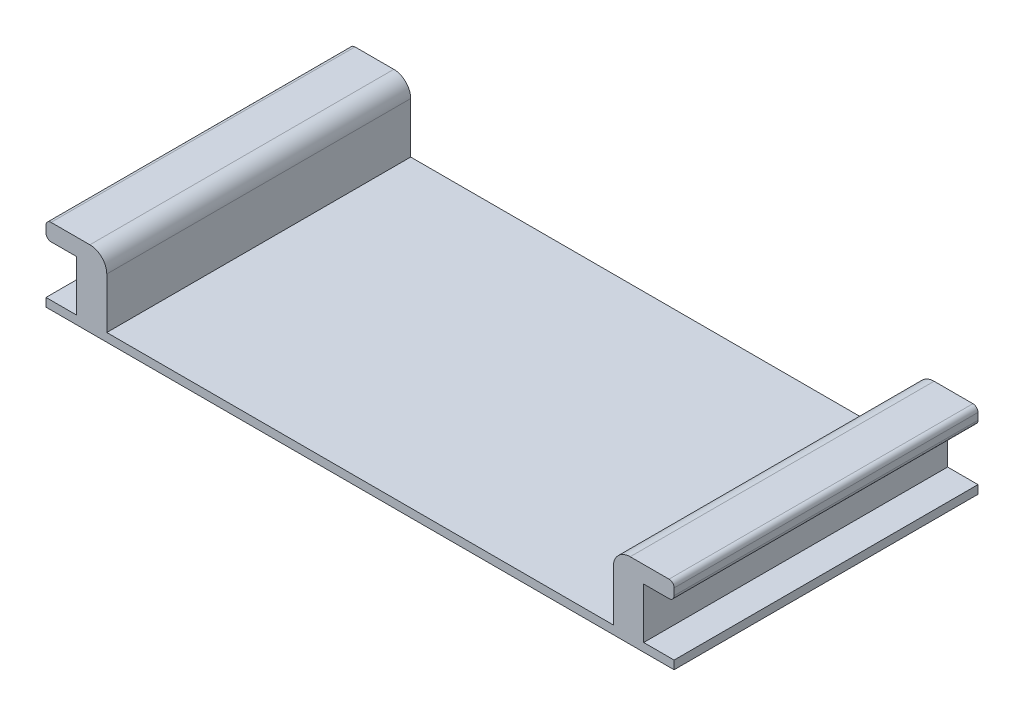
ISO-10303-21;
HEADER;
FILE_DESCRIPTION(('STEP AP214'),'2;1');
FILE_NAME('part.step','',(''),(''),'','','');
FILE_SCHEMA(('AUTOMOTIVE_DESIGN { 1 0 10303 214 1 1 1 1 }'));
ENDSEC;
DATA;
#1=APPLICATION_CONTEXT('core data for automotive mechanical design processes');
#2=APPLICATION_PROTOCOL_DEFINITION('international standard','automotive_design',2000,#1);
#3=PRODUCT_CONTEXT('',#1,'mechanical');
#4=PRODUCT('Part','Part','',(#3));
#5=PRODUCT_RELATED_PRODUCT_CATEGORY('part','',(#4));
#6=PRODUCT_DEFINITION_FORMATION('','',#4);
#7=PRODUCT_DEFINITION_CONTEXT('part definition',#1,'design');
#8=PRODUCT_DEFINITION('design','',#6,#7);
#9=PRODUCT_DEFINITION_SHAPE('','',#8);
#10=(LENGTH_UNIT() NAMED_UNIT(*) SI_UNIT(.MILLI.,.METRE.));
#11=(NAMED_UNIT(*) PLANE_ANGLE_UNIT() SI_UNIT($,.RADIAN.));
#12=(NAMED_UNIT(*) SI_UNIT($,.STERADIAN.) SOLID_ANGLE_UNIT());
#13=UNCERTAINTY_MEASURE_WITH_UNIT(LENGTH_MEASURE(1.E-05),#10,'distance_accuracy_value','');
#14=(GEOMETRIC_REPRESENTATION_CONTEXT(3) GLOBAL_UNCERTAINTY_ASSIGNED_CONTEXT((#13)) GLOBAL_UNIT_ASSIGNED_CONTEXT((#10,
#11,#12)) REPRESENTATION_CONTEXT('',''));
#15=CARTESIAN_POINT('',(0.,0.,0.));
#16=DIRECTION('',(0.,0.,1.));
#17=DIRECTION('',(1.,0.,0.));
#18=AXIS2_PLACEMENT_3D('',#15,#16,#17);
#19=CARTESIAN_POINT('',(-18.6,-0.5,18.));
#20=DIRECTION('',(1.,0.,0.));
#21=DIRECTION('',(0.,0.,-1.));
#22=AXIS2_PLACEMENT_3D('',#19,#20,#21);
#23=PLANE('',#22);
#24=DIRECTION('',(0.,-1.,0.));
#25=VECTOR('',#24,1.);
#26=CARTESIAN_POINT('',(-18.6,-0.5,0.));
#27=LINE('',#26,#25);
#28=CARTESIAN_POINT('',(-18.6,0.,0.));
#29=VERTEX_POINT('',#28);
#30=CARTESIAN_POINT('',(-18.6,-0.5,0.));
#31=VERTEX_POINT('',#30);
#32=EDGE_CURVE('E214',#29,#31,#27,.T.);
#33=ORIENTED_EDGE('',*,*,#32,.T.);
#34=DIRECTION('',(0.,0.,-1.));
#35=VECTOR('',#34,1.);
#36=CARTESIAN_POINT('',(-18.6,-0.5,18.));
#37=LINE('',#36,#35);
#38=CARTESIAN_POINT('',(-18.6,-0.5,18.));
#39=VERTEX_POINT('',#38);
#40=EDGE_CURVE('E193',#39,#31,#37,.T.);
#41=ORIENTED_EDGE('',*,*,#40,.F.);
#42=DIRECTION('',(0.,-1.,0.));
#43=VECTOR('',#42,1.);
#44=CARTESIAN_POINT('',(-18.6,-0.5,18.));
#45=LINE('',#44,#43);
#46=CARTESIAN_POINT('',(-18.6,0.,18.));
#47=VERTEX_POINT('',#46);
#48=EDGE_CURVE('E200',#47,#39,#45,.T.);
#49=ORIENTED_EDGE('',*,*,#48,.F.);
#50=DIRECTION('',(0.,0.,-1.));
#51=VECTOR('',#50,1.);
#52=CARTESIAN_POINT('',(-18.6,0.,18.));
#53=LINE('',#52,#51);
#54=EDGE_CURVE('E324',#47,#29,#53,.T.);
#55=ORIENTED_EDGE('',*,*,#54,.T.);
#56=EDGE_LOOP('',(#33,#41,#49,#55));
#57=FACE_BOUND('',#56,.T.);
#58=ADVANCED_FACE('F39',(#57),#23,.F.);
#59=CARTESIAN_POINT('',(-18.6,-0.5,18.));
#60=DIRECTION('',(0.,1.,0.));
#61=DIRECTION('',(0.,0.,1.));
#62=AXIS2_PLACEMENT_3D('',#59,#60,#61);
#63=PLANE('',#62);
#64=DIRECTION('',(1.,0.,0.));
#65=VECTOR('',#64,1.);
#66=CARTESIAN_POINT('',(-18.6,-0.5,0.));
#67=LINE('',#66,#65);
#68=CARTESIAN_POINT('',(18.6,-0.5,0.));
#69=VERTEX_POINT('',#68);
#70=EDGE_CURVE('E372',#31,#69,#67,.T.);
#71=ORIENTED_EDGE('',*,*,#70,.T.);
#72=DIRECTION('',(0.,0.,-1.));
#73=VECTOR('',#72,1.);
#74=CARTESIAN_POINT('',(18.6,-0.5,18.));
#75=LINE('',#74,#73);
#76=CARTESIAN_POINT('',(18.6,-0.5,18.));
#77=VERTEX_POINT('',#76);
#78=EDGE_CURVE('E196',#77,#69,#75,.T.);
#79=ORIENTED_EDGE('',*,*,#78,.F.);
#80=DIRECTION('',(1.,0.,0.));
#81=VECTOR('',#80,1.);
#82=CARTESIAN_POINT('',(-18.6,-0.5,18.));
#83=LINE('',#82,#81);
#84=EDGE_CURVE('E189',#39,#77,#83,.T.);
#85=ORIENTED_EDGE('',*,*,#84,.F.);
#86=ORIENTED_EDGE('',*,*,#40,.T.);
#87=EDGE_LOOP('',(#71,#79,#85,#86));
#88=FACE_BOUND('',#87,.T.);
#89=ADVANCED_FACE('F191',(#88),#63,.F.);
#90=CARTESIAN_POINT('',(18.6,-0.5,18.));
#91=DIRECTION('',(-1.,0.,0.));
#92=DIRECTION('',(0.,0.,1.));
#93=AXIS2_PLACEMENT_3D('',#90,#91,#92);
#94=PLANE('',#93);
#95=DIRECTION('',(0.,1.,0.));
#96=VECTOR('',#95,1.);
#97=CARTESIAN_POINT('',(18.6,-0.5,0.));
#98=LINE('',#97,#96);
#99=CARTESIAN_POINT('',(18.6,0.,0.));
#100=VERTEX_POINT('',#99);
#101=EDGE_CURVE('E363',#69,#100,#98,.T.);
#102=ORIENTED_EDGE('',*,*,#101,.T.);
#103=DIRECTION('',(0.,0.,-1.));
#104=VECTOR('',#103,1.);
#105=CARTESIAN_POINT('',(18.6,0.,18.));
#106=LINE('',#105,#104);
#107=CARTESIAN_POINT('',(18.6,0.,18.));
#108=VERTEX_POINT('',#107);
#109=EDGE_CURVE('E223',#108,#100,#106,.T.);
#110=ORIENTED_EDGE('',*,*,#109,.F.);
#111=DIRECTION('',(0.,1.,0.));
#112=VECTOR('',#111,1.);
#113=CARTESIAN_POINT('',(18.6,-0.5,18.));
#114=LINE('',#113,#112);
#115=EDGE_CURVE('E199',#77,#108,#114,.T.);
#116=ORIENTED_EDGE('',*,*,#115,.F.);
#117=ORIENTED_EDGE('',*,*,#78,.T.);
#118=EDGE_LOOP('',(#102,#110,#116,#117));
#119=FACE_BOUND('',#118,.T.);
#120=ADVANCED_FACE('F431',(#119),#94,.F.);
#121=CARTESIAN_POINT('',(16.8,0.,18.));
#122=DIRECTION('',(0.,-1.,0.));
#123=DIRECTION('',(0.,0.,-1.));
#124=AXIS2_PLACEMENT_3D('',#121,#122,#123);
#125=PLANE('',#124);
#126=DIRECTION('',(-1.,0.,0.));
#127=VECTOR('',#126,1.);
#128=CARTESIAN_POINT('',(16.8,0.,0.));
#129=LINE('',#128,#127);
#130=CARTESIAN_POINT('',(16.8,0.,0.));
#131=VERTEX_POINT('',#130);
#132=EDGE_CURVE('E358',#100,#131,#129,.T.);
#133=ORIENTED_EDGE('',*,*,#132,.T.);
#134=DIRECTION('',(0.,0.,-1.));
#135=VECTOR('',#134,1.);
#136=CARTESIAN_POINT('',(16.8,0.,18.));
#137=LINE('',#136,#135);
#138=CARTESIAN_POINT('',(16.8,0.,18.));
#139=VERTEX_POINT('',#138);
#140=EDGE_CURVE('E347',#139,#131,#137,.T.);
#141=ORIENTED_EDGE('',*,*,#140,.F.);
#142=DIRECTION('',(-1.,0.,0.));
#143=VECTOR('',#142,1.);
#144=CARTESIAN_POINT('',(16.8,0.,18.));
#145=LINE('',#144,#143);
#146=EDGE_CURVE('E359',#108,#139,#145,.T.);
#147=ORIENTED_EDGE('',*,*,#146,.F.);
#148=ORIENTED_EDGE('',*,*,#109,.T.);
#149=EDGE_LOOP('',(#133,#141,#147,#148));
#150=FACE_BOUND('',#149,.T.);
#151=ADVANCED_FACE('F356',(#150),#125,.F.);
#152=CARTESIAN_POINT('',(16.8,3.,18.));
#153=DIRECTION('',(-1.,0.,0.));
#154=DIRECTION('',(0.,0.,1.));
#155=AXIS2_PLACEMENT_3D('',#152,#153,#154);
#156=PLANE('',#155);
#157=DIRECTION('',(0.,1.,0.));
#158=VECTOR('',#157,1.);
#159=CARTESIAN_POINT('',(16.8,3.,0.));
#160=LINE('',#159,#158);
#161=CARTESIAN_POINT('',(16.8,3.,0.));
#162=VERTEX_POINT('',#161);
#163=EDGE_CURVE('E365',#131,#162,#160,.T.);
#164=ORIENTED_EDGE('',*,*,#163,.T.);
#165=DIRECTION('',(0.,0.,-1.));
#166=VECTOR('',#165,1.);
#167=CARTESIAN_POINT('',(16.8,3.,18.));
#168=LINE('',#167,#166);
#169=CARTESIAN_POINT('',(16.8,3.,18.));
#170=VERTEX_POINT('',#169);
#171=EDGE_CURVE('E343',#170,#162,#168,.T.);
#172=ORIENTED_EDGE('',*,*,#171,.F.);
#173=DIRECTION('',(0.,1.,0.));
#174=VECTOR('',#173,1.);
#175=CARTESIAN_POINT('',(16.8,3.,18.));
#176=LINE('',#175,#174);
#177=EDGE_CURVE('E435',#139,#170,#176,.T.);
#178=ORIENTED_EDGE('',*,*,#177,.F.);
#179=ORIENTED_EDGE('',*,*,#140,.T.);
#180=EDGE_LOOP('',(#164,#172,#178,#179));
#181=FACE_BOUND('',#180,.T.);
#182=ADVANCED_FACE('F489',(#181),#156,.F.);
#183=CARTESIAN_POINT('',(18.6,3.,18.));
#184=DIRECTION('',(0.,1.,0.));
#185=DIRECTION('',(0.,0.,1.));
#186=AXIS2_PLACEMENT_3D('',#183,#184,#185);
#187=PLANE('',#186);
#188=DIRECTION('',(1.,0.,0.));
#189=VECTOR('',#188,1.);
#190=CARTESIAN_POINT('',(18.6,3.,0.));
#191=LINE('',#190,#189);
#192=CARTESIAN_POINT('',(18.3,3.,0.));
#193=VERTEX_POINT('',#192);
#194=EDGE_CURVE('E370',#162,#193,#191,.T.);
#195=ORIENTED_EDGE('',*,*,#194,.T.);
#196=DIRECTION('',(0.,0.,-1.));
#197=VECTOR('',#196,1.);
#198=CARTESIAN_POINT('',(18.3,3.,18.));
#199=LINE('',#198,#197);
#200=CARTESIAN_POINT('',(18.3,3.,18.));
#201=VERTEX_POINT('',#200);
#202=EDGE_CURVE('E269',#193,#201,#199,.F.);
#203=ORIENTED_EDGE('',*,*,#202,.T.);
#204=DIRECTION('',(1.,0.,0.));
#205=VECTOR('',#204,1.);
#206=CARTESIAN_POINT('',(18.6,3.,18.));
#207=LINE('',#206,#205);
#208=EDGE_CURVE('E440',#170,#201,#207,.T.);
#209=ORIENTED_EDGE('',*,*,#208,.F.);
#210=ORIENTED_EDGE('',*,*,#171,.T.);
#211=EDGE_LOOP('',(#195,#203,#209,#210));
#212=FACE_BOUND('',#211,.T.);
#213=ADVANCED_FACE('F484',(#212),#187,.F.);
#214=CARTESIAN_POINT('',(18.6,4.,18.));
#215=DIRECTION('',(-1.,0.,0.));
#216=DIRECTION('',(0.,0.,1.));
#217=AXIS2_PLACEMENT_3D('',#214,#215,#216);
#218=PLANE('',#217);
#219=DIRECTION('',(0.,1.,0.));
#220=VECTOR('',#219,1.);
#221=CARTESIAN_POINT('',(18.6,4.,18.));
#222=LINE('',#221,#220);
#223=CARTESIAN_POINT('',(18.6,3.3,18.));
#224=VERTEX_POINT('',#223);
#225=CARTESIAN_POINT('',(18.6,3.7,18.));
#226=VERTEX_POINT('',#225);
#227=EDGE_CURVE('E443',#224,#226,#222,.T.);
#228=ORIENTED_EDGE('',*,*,#227,.F.);
#229=DIRECTION('',(0.,0.,-1.));
#230=VECTOR('',#229,1.);
#231=CARTESIAN_POINT('',(18.6,3.3,18.));
#232=LINE('',#231,#230);
#233=CARTESIAN_POINT('',(18.6,3.3,0.));
#234=VERTEX_POINT('',#233);
#235=EDGE_CURVE('E253',#224,#234,#232,.T.);
#236=ORIENTED_EDGE('',*,*,#235,.T.);
#237=DIRECTION('',(0.,1.,0.));
#238=VECTOR('',#237,1.);
#239=CARTESIAN_POINT('',(18.6,4.,0.));
#240=LINE('',#239,#238);
#241=CARTESIAN_POINT('',(18.6,3.7,0.));
#242=VERTEX_POINT('',#241);
#243=EDGE_CURVE('E379',#234,#242,#240,.T.);
#244=ORIENTED_EDGE('',*,*,#243,.T.);
#245=DIRECTION('',(0.,0.,-1.));
#246=VECTOR('',#245,1.);
#247=CARTESIAN_POINT('',(18.6,3.7,18.));
#248=LINE('',#247,#246);
#249=EDGE_CURVE('E250',#242,#226,#248,.F.);
#250=ORIENTED_EDGE('',*,*,#249,.T.);
#251=EDGE_LOOP('',(#228,#236,#244,#250));
#252=FACE_BOUND('',#251,.T.);
#253=ADVANCED_FACE('F475',(#252),#218,.F.);
#254=CARTESIAN_POINT('',(15.,4.,18.));
#255=DIRECTION('',(0.,-1.,0.));
#256=DIRECTION('',(0.,0.,-1.));
#257=AXIS2_PLACEMENT_3D('',#254,#255,#256);
#258=PLANE('',#257);
#259=DIRECTION('',(-1.,0.,0.));
#260=VECTOR('',#259,1.);
#261=CARTESIAN_POINT('',(15.,4.,18.));
#262=LINE('',#261,#260);
#263=CARTESIAN_POINT('',(18.3,4.,18.));
#264=VERTEX_POINT('',#263);
#265=CARTESIAN_POINT('',(16.,4.,18.));
#266=VERTEX_POINT('',#265);
#267=EDGE_CURVE('E447',#264,#266,#262,.T.);
#268=ORIENTED_EDGE('',*,*,#267,.F.);
#269=DIRECTION('',(0.,0.,-1.));
#270=VECTOR('',#269,1.);
#271=CARTESIAN_POINT('',(18.3,4.,18.));
#272=LINE('',#271,#270);
#273=CARTESIAN_POINT('',(18.3,4.,0.));
#274=VERTEX_POINT('',#273);
#275=EDGE_CURVE('E283',#264,#274,#272,.T.);
#276=ORIENTED_EDGE('',*,*,#275,.T.);
#277=DIRECTION('',(-1.,0.,0.));
#278=VECTOR('',#277,1.);
#279=CARTESIAN_POINT('',(15.,4.,0.));
#280=LINE('',#279,#278);
#281=CARTESIAN_POINT('',(16.,4.,0.));
#282=VERTEX_POINT('',#281);
#283=EDGE_CURVE('E383',#274,#282,#280,.T.);
#284=ORIENTED_EDGE('',*,*,#283,.T.);
#285=DIRECTION('',(0.,0.,-1.));
#286=VECTOR('',#285,1.);
#287=CARTESIAN_POINT('',(16.,4.,18.));
#288=LINE('',#287,#286);
#289=EDGE_CURVE('E233',#282,#266,#288,.F.);
#290=ORIENTED_EDGE('',*,*,#289,.T.);
#291=EDGE_LOOP('',(#268,#276,#284,#290));
#292=FACE_BOUND('',#291,.T.);
#293=ADVANCED_FACE('F469',(#292),#258,.F.);
#294=CARTESIAN_POINT('',(15.,0.,18.));
#295=DIRECTION('',(1.,0.,0.));
#296=DIRECTION('',(0.,1.,0.));
#297=AXIS2_PLACEMENT_3D('',#294,#295,#296);
#298=PLANE('',#297);
#299=DIRECTION('',(0.,-1.,0.));
#300=VECTOR('',#299,1.);
#301=CARTESIAN_POINT('',(15.,0.,18.));
#302=LINE('',#301,#300);
#303=CARTESIAN_POINT('',(15.,3.,18.));
#304=VERTEX_POINT('',#303);
#305=CARTESIAN_POINT('',(15.,0.,18.));
#306=VERTEX_POINT('',#305);
#307=EDGE_CURVE('E450',#304,#306,#302,.T.);
#308=ORIENTED_EDGE('',*,*,#307,.F.);
#309=DIRECTION('',(0.,0.,-1.));
#310=VECTOR('',#309,1.);
#311=CARTESIAN_POINT('',(15.,3.,18.));
#312=LINE('',#311,#310);
#313=CARTESIAN_POINT('',(15.,3.,0.));
#314=VERTEX_POINT('',#313);
#315=EDGE_CURVE('E216',#304,#314,#312,.T.);
#316=ORIENTED_EDGE('',*,*,#315,.T.);
#317=DIRECTION('',(0.,-1.,0.));
#318=VECTOR('',#317,1.);
#319=CARTESIAN_POINT('',(15.,0.,0.));
#320=LINE('',#319,#318);
#321=CARTESIAN_POINT('',(15.,0.,0.));
#322=VERTEX_POINT('',#321);
#323=EDGE_CURVE('E386',#314,#322,#320,.T.);
#324=ORIENTED_EDGE('',*,*,#323,.T.);
#325=DIRECTION('',(0.,0.,-1.));
#326=VECTOR('',#325,1.);
#327=CARTESIAN_POINT('',(15.,0.,18.));
#328=LINE('',#327,#326);
#329=EDGE_CURVE('E339',#306,#322,#328,.T.);
#330=ORIENTED_EDGE('',*,*,#329,.F.);
#331=EDGE_LOOP('',(#308,#316,#324,#330));
#332=FACE_BOUND('',#331,.T.);
#333=ADVANCED_FACE('F462',(#332),#298,.F.);
#334=CARTESIAN_POINT('',(-15.,0.,18.));
#335=DIRECTION('',(0.,-1.,0.));
#336=DIRECTION('',(0.,0.,-1.));
#337=AXIS2_PLACEMENT_3D('',#334,#335,#336);
#338=PLANE('',#337);
#339=DIRECTION('',(-1.,0.,0.));
#340=VECTOR('',#339,1.);
#341=CARTESIAN_POINT('',(-15.,0.,0.));
#342=LINE('',#341,#340);
#343=CARTESIAN_POINT('',(-15.,0.,0.));
#344=VERTEX_POINT('',#343);
#345=EDGE_CURVE('E389',#322,#344,#342,.T.);
#346=ORIENTED_EDGE('',*,*,#345,.T.);
#347=DIRECTION('',(0.,0.,-1.));
#348=VECTOR('',#347,1.);
#349=CARTESIAN_POINT('',(-15.,0.,18.));
#350=LINE('',#349,#348);
#351=CARTESIAN_POINT('',(-15.,0.,18.));
#352=VERTEX_POINT('',#351);
#353=EDGE_CURVE('E335',#352,#344,#350,.T.);
#354=ORIENTED_EDGE('',*,*,#353,.F.);
#355=DIRECTION('',(-1.,0.,0.));
#356=VECTOR('',#355,1.);
#357=CARTESIAN_POINT('',(-15.,0.,18.));
#358=LINE('',#357,#356);
#359=EDGE_CURVE('E418',#306,#352,#358,.T.);
#360=ORIENTED_EDGE('',*,*,#359,.F.);
#361=ORIENTED_EDGE('',*,*,#329,.T.);
#362=EDGE_LOOP('',(#346,#354,#360,#361));
#363=FACE_BOUND('',#362,.T.);
#364=ADVANCED_FACE('F457',(#363),#338,.F.);
#365=CARTESIAN_POINT('',(-15.,0.,18.));
#366=DIRECTION('',(-1.,0.,0.));
#367=DIRECTION('',(0.,-1.,0.));
#368=AXIS2_PLACEMENT_3D('',#365,#366,#367);
#369=PLANE('',#368);
#370=DIRECTION('',(0.,1.,0.));
#371=VECTOR('',#370,1.);
#372=CARTESIAN_POINT('',(-15.,0.,0.));
#373=LINE('',#372,#371);
#374=CARTESIAN_POINT('',(-15.,3.,0.));
#375=VERTEX_POINT('',#374);
#376=EDGE_CURVE('E316',#344,#375,#373,.T.);
#377=ORIENTED_EDGE('',*,*,#376,.T.);
#378=DIRECTION('',(0.,0.,-1.));
#379=VECTOR('',#378,1.);
#380=CARTESIAN_POINT('',(-15.,3.,18.));
#381=LINE('',#380,#379);
#382=CARTESIAN_POINT('',(-15.,3.,18.));
#383=VERTEX_POINT('',#382);
#384=EDGE_CURVE('E247',#375,#383,#381,.F.);
#385=ORIENTED_EDGE('',*,*,#384,.T.);
#386=DIRECTION('',(0.,1.,0.));
#387=VECTOR('',#386,1.);
#388=CARTESIAN_POINT('',(-15.,0.,18.));
#389=LINE('',#388,#387);
#390=EDGE_CURVE('E408',#352,#383,#389,.T.);
#391=ORIENTED_EDGE('',*,*,#390,.F.);
#392=ORIENTED_EDGE('',*,*,#353,.T.);
#393=EDGE_LOOP('',(#377,#385,#391,#392));
#394=FACE_BOUND('',#393,.T.);
#395=ADVANCED_FACE('F396',(#394),#369,.F.);
#396=CARTESIAN_POINT('',(-15.,4.,18.));
#397=DIRECTION('',(0.,-1.,0.));
#398=DIRECTION('',(0.,0.,-1.));
#399=AXIS2_PLACEMENT_3D('',#396,#397,#398);
#400=PLANE('',#399);
#401=DIRECTION('',(-1.,0.,0.));
#402=VECTOR('',#401,1.);
#403=CARTESIAN_POINT('',(-15.,4.,0.));
#404=LINE('',#403,#402);
#405=CARTESIAN_POINT('',(-16.,4.,0.));
#406=VERTEX_POINT('',#405);
#407=CARTESIAN_POINT('',(-18.3,4.,0.));
#408=VERTEX_POINT('',#407);
#409=EDGE_CURVE('E310',#406,#408,#404,.T.);
#410=ORIENTED_EDGE('',*,*,#409,.T.);
#411=DIRECTION('',(0.,0.,-1.));
#412=VECTOR('',#411,1.);
#413=CARTESIAN_POINT('',(-18.3,4.,18.));
#414=LINE('',#413,#412);
#415=CARTESIAN_POINT('',(-18.3,4.,18.));
#416=VERTEX_POINT('',#415);
#417=EDGE_CURVE('E11',#408,#416,#414,.F.);
#418=ORIENTED_EDGE('',*,*,#417,.T.);
#419=DIRECTION('',(-1.,0.,0.));
#420=VECTOR('',#419,1.);
#421=CARTESIAN_POINT('',(-15.,4.,18.));
#422=LINE('',#421,#420);
#423=CARTESIAN_POINT('',(-16.,4.,18.));
#424=VERTEX_POINT('',#423);
#425=EDGE_CURVE('E407',#424,#416,#422,.T.);
#426=ORIENTED_EDGE('',*,*,#425,.F.);
#427=DIRECTION('',(0.,0.,-1.));
#428=VECTOR('',#427,1.);
#429=CARTESIAN_POINT('',(-16.,4.,18.));
#430=LINE('',#429,#428);
#431=EDGE_CURVE('E243',#424,#406,#430,.T.);
#432=ORIENTED_EDGE('',*,*,#431,.T.);
#433=EDGE_LOOP('',(#410,#418,#426,#432));
#434=FACE_BOUND('',#433,.T.);
#435=ADVANCED_FACE('F410',(#434),#400,.F.);
#436=CARTESIAN_POINT('',(-18.6,4.,18.));
#437=DIRECTION('',(1.,0.,0.));
#438=DIRECTION('',(0.,0.,-1.));
#439=AXIS2_PLACEMENT_3D('',#436,#437,#438);
#440=PLANE('',#439);
#441=DIRECTION('',(0.,-1.,0.));
#442=VECTOR('',#441,1.);
#443=CARTESIAN_POINT('',(-18.6,4.,0.));
#444=LINE('',#443,#442);
#445=CARTESIAN_POINT('',(-18.6,3.7,0.));
#446=VERTEX_POINT('',#445);
#447=CARTESIAN_POINT('',(-18.6,3.3,0.));
#448=VERTEX_POINT('',#447);
#449=EDGE_CURVE('E298',#446,#448,#444,.T.);
#450=ORIENTED_EDGE('',*,*,#449,.T.);
#451=DIRECTION('',(0.,0.,-1.));
#452=VECTOR('',#451,1.);
#453=CARTESIAN_POINT('',(-18.6,3.3,18.));
#454=LINE('',#453,#452);
#455=CARTESIAN_POINT('',(-18.6,3.3,18.));
#456=VERTEX_POINT('',#455);
#457=EDGE_CURVE('E48',#448,#456,#454,.F.);
#458=ORIENTED_EDGE('',*,*,#457,.T.);
#459=DIRECTION('',(0.,-1.,0.));
#460=VECTOR('',#459,1.);
#461=CARTESIAN_POINT('',(-18.6,4.,18.));
#462=LINE('',#461,#460);
#463=CARTESIAN_POINT('',(-18.6,3.7,18.));
#464=VERTEX_POINT('',#463);
#465=EDGE_CURVE('E299',#464,#456,#462,.T.);
#466=ORIENTED_EDGE('',*,*,#465,.F.);
#467=DIRECTION('',(0.,0.,-1.));
#468=VECTOR('',#467,1.);
#469=CARTESIAN_POINT('',(-18.6,3.7,18.));
#470=LINE('',#469,#468);
#471=EDGE_CURVE('E291',#464,#446,#470,.T.);
#472=ORIENTED_EDGE('',*,*,#471,.T.);
#473=EDGE_LOOP('',(#450,#458,#466,#472));
#474=FACE_BOUND('',#473,.T.);
#475=ADVANCED_FACE('F297',(#474),#440,.F.);
#476=CARTESIAN_POINT('',(-18.6,3.,18.));
#477=DIRECTION('',(0.,1.,0.));
#478=DIRECTION('',(0.,0.,1.));
#479=AXIS2_PLACEMENT_3D('',#476,#477,#478);
#480=PLANE('',#479);
#481=DIRECTION('',(1.,0.,0.));
#482=VECTOR('',#481,1.);
#483=CARTESIAN_POINT('',(-18.6,3.,18.));
#484=LINE('',#483,#482);
#485=CARTESIAN_POINT('',(-18.3,3.,18.));
#486=VERTEX_POINT('',#485);
#487=CARTESIAN_POINT('',(-16.8,3.,18.));
#488=VERTEX_POINT('',#487);
#489=EDGE_CURVE('E416',#486,#488,#484,.T.);
#490=ORIENTED_EDGE('',*,*,#489,.F.);
#491=DIRECTION('',(0.,0.,-1.));
#492=VECTOR('',#491,1.);
#493=CARTESIAN_POINT('',(-18.3,3.,18.));
#494=LINE('',#493,#492);
#495=CARTESIAN_POINT('',(-18.3,3.,0.));
#496=VERTEX_POINT('',#495);
#497=EDGE_CURVE('E287',#486,#496,#494,.T.);
#498=ORIENTED_EDGE('',*,*,#497,.T.);
#499=DIRECTION('',(1.,0.,0.));
#500=VECTOR('',#499,1.);
#501=CARTESIAN_POINT('',(-18.6,3.,0.));
#502=LINE('',#501,#500);
#503=CARTESIAN_POINT('',(-16.8,3.,0.));
#504=VERTEX_POINT('',#503);
#505=EDGE_CURVE('E309',#496,#504,#502,.T.);
#506=ORIENTED_EDGE('',*,*,#505,.T.);
#507=DIRECTION('',(0.,0.,-1.));
#508=VECTOR('',#507,1.);
#509=CARTESIAN_POINT('',(-16.8,3.,18.));
#510=LINE('',#509,#508);
#511=EDGE_CURVE('E331',#488,#504,#510,.T.);
#512=ORIENTED_EDGE('',*,*,#511,.F.);
#513=EDGE_LOOP('',(#490,#498,#506,#512));
#514=FACE_BOUND('',#513,.T.);
#515=ADVANCED_FACE('F521',(#514),#480,.F.);
#516=CARTESIAN_POINT('',(-16.8,3.,18.));
#517=DIRECTION('',(1.,0.,0.));
#518=DIRECTION('',(0.,0.,-1.));
#519=AXIS2_PLACEMENT_3D('',#516,#517,#518);
#520=PLANE('',#519);
#521=DIRECTION('',(0.,-1.,0.));
#522=VECTOR('',#521,1.);
#523=CARTESIAN_POINT('',(-16.8,3.,0.));
#524=LINE('',#523,#522);
#525=CARTESIAN_POINT('',(-16.8,0.,0.));
#526=VERTEX_POINT('',#525);
#527=EDGE_CURVE('E314',#504,#526,#524,.T.);
#528=ORIENTED_EDGE('',*,*,#527,.T.);
#529=DIRECTION('',(0.,0.,-1.));
#530=VECTOR('',#529,1.);
#531=CARTESIAN_POINT('',(-16.8,0.,18.));
#532=LINE('',#531,#530);
#533=CARTESIAN_POINT('',(-16.8,0.,18.));
#534=VERTEX_POINT('',#533);
#535=EDGE_CURVE('E327',#534,#526,#532,.T.);
#536=ORIENTED_EDGE('',*,*,#535,.F.);
#537=DIRECTION('',(0.,-1.,0.));
#538=VECTOR('',#537,1.);
#539=CARTESIAN_POINT('',(-16.8,3.,18.));
#540=LINE('',#539,#538);
#541=EDGE_CURVE('E424',#488,#534,#540,.T.);
#542=ORIENTED_EDGE('',*,*,#541,.F.);
#543=ORIENTED_EDGE('',*,*,#511,.T.);
#544=EDGE_LOOP('',(#528,#536,#542,#543));
#545=FACE_BOUND('',#544,.T.);
#546=ADVANCED_FACE('F527',(#545),#520,.F.);
#547=CARTESIAN_POINT('',(-18.6,0.,18.));
#548=DIRECTION('',(0.,-1.,0.));
#549=DIRECTION('',(0.,0.,-1.));
#550=AXIS2_PLACEMENT_3D('',#547,#548,#549);
#551=PLANE('',#550);
#552=DIRECTION('',(-1.,0.,0.));
#553=VECTOR('',#552,1.);
#554=CARTESIAN_POINT('',(-18.6,0.,0.));
#555=LINE('',#554,#553);
#556=EDGE_CURVE('E211',#526,#29,#555,.T.);
#557=ORIENTED_EDGE('',*,*,#556,.T.);
#558=ORIENTED_EDGE('',*,*,#54,.F.);
#559=DIRECTION('',(-1.,0.,0.));
#560=VECTOR('',#559,1.);
#561=CARTESIAN_POINT('',(-18.6,0.,18.));
#562=LINE('',#561,#560);
#563=EDGE_CURVE('E206',#534,#47,#562,.T.);
#564=ORIENTED_EDGE('',*,*,#563,.F.);
#565=ORIENTED_EDGE('',*,*,#535,.T.);
#566=EDGE_LOOP('',(#557,#558,#564,#565));
#567=FACE_BOUND('',#566,.T.);
#568=ADVANCED_FACE('F530',(#567),#551,.F.);
#569=CARTESIAN_POINT('',(0.,0.,18.));
#570=DIRECTION('',(0.,0.,-1.));
#571=DIRECTION('',(-1.,0.,0.));
#572=AXIS2_PLACEMENT_3D('',#569,#570,#571);
#573=PLANE('',#572);
#574=ORIENTED_EDGE('',*,*,#208,.T.);
#575=CARTESIAN_POINT('',(18.3,3.3,18.));
#576=DIRECTION('',(0.,0.,-1.));
#577=DIRECTION('',(-1.,0.,0.));
#578=AXIS2_PLACEMENT_3D('',#575,#576,#577);
#579=CIRCLE('',#578,0.3);
#580=EDGE_CURVE('E280',#201,#224,#579,.F.);
#581=ORIENTED_EDGE('',*,*,#580,.T.);
#582=ORIENTED_EDGE('',*,*,#227,.T.);
#583=CARTESIAN_POINT('',(18.3,3.7,18.));
#584=DIRECTION('',(0.,0.,-1.));
#585=DIRECTION('',(-1.,0.,0.));
#586=AXIS2_PLACEMENT_3D('',#583,#584,#585);
#587=CIRCLE('',#586,0.3);
#588=EDGE_CURVE('E277',#226,#264,#587,.F.);
#589=ORIENTED_EDGE('',*,*,#588,.T.);
#590=ORIENTED_EDGE('',*,*,#267,.T.);
#591=CARTESIAN_POINT('',(16.,3.,18.));
#592=DIRECTION('',(0.,0.,-1.));
#593=DIRECTION('',(-1.,0.,0.));
#594=AXIS2_PLACEMENT_3D('',#591,#592,#593);
#595=CIRCLE('',#594,1.);
#596=EDGE_CURVE('E240',#266,#304,#595,.F.);
#597=ORIENTED_EDGE('',*,*,#596,.T.);
#598=ORIENTED_EDGE('',*,*,#307,.T.);
#599=ORIENTED_EDGE('',*,*,#359,.T.);
#600=ORIENTED_EDGE('',*,*,#390,.T.);
#601=CARTESIAN_POINT('',(-16.,3.,18.));
#602=DIRECTION('',(0.,0.,-1.));
#603=DIRECTION('',(-1.,0.,0.));
#604=AXIS2_PLACEMENT_3D('',#601,#602,#603);
#605=CIRCLE('',#604,1.);
#606=EDGE_CURVE('E237',#383,#424,#605,.F.);
#607=ORIENTED_EDGE('',*,*,#606,.T.);
#608=ORIENTED_EDGE('',*,*,#425,.T.);
#609=CARTESIAN_POINT('',(-18.3,3.7,18.));
#610=DIRECTION('',(0.,0.,-1.));
#611=DIRECTION('',(-1.,0.,0.));
#612=AXIS2_PLACEMENT_3D('',#609,#610,#611);
#613=CIRCLE('',#612,0.3);
#614=EDGE_CURVE('E272',#416,#464,#613,.F.);
#615=ORIENTED_EDGE('',*,*,#614,.T.);
#616=ORIENTED_EDGE('',*,*,#465,.T.);
#617=CARTESIAN_POINT('',(-18.3,3.3,18.));
#618=DIRECTION('',(0.,0.,-1.));
#619=DIRECTION('',(-1.,0.,0.));
#620=AXIS2_PLACEMENT_3D('',#617,#618,#619);
#621=CIRCLE('',#620,0.3);
#622=EDGE_CURVE('E55',#456,#486,#621,.F.);
#623=ORIENTED_EDGE('',*,*,#622,.T.);
#624=ORIENTED_EDGE('',*,*,#489,.T.);
#625=ORIENTED_EDGE('',*,*,#541,.T.);
#626=ORIENTED_EDGE('',*,*,#563,.T.);
#627=ORIENTED_EDGE('',*,*,#48,.T.);
#628=ORIENTED_EDGE('',*,*,#84,.T.);
#629=ORIENTED_EDGE('',*,*,#115,.T.);
#630=ORIENTED_EDGE('',*,*,#146,.T.);
#631=ORIENTED_EDGE('',*,*,#177,.T.);
#632=EDGE_LOOP('',(#574,#581,#582,#589,#590,#597,#598,#599,#600,#607,#608,#615,#616,#623,#624,
#625,#626,#627,#628,#629,#630,#631));
#633=FACE_BOUND('',#632,.T.);
#634=ADVANCED_FACE('F204',(#633),#573,.F.);
#635=CARTESIAN_POINT('',(0.,0.,0.));
#636=DIRECTION('',(0.,0.,-1.));
#637=DIRECTION('',(-1.,0.,0.));
#638=AXIS2_PLACEMENT_3D('',#635,#636,#637);
#639=PLANE('',#638);
#640=ORIENTED_EDGE('',*,*,#243,.F.);
#641=CARTESIAN_POINT('',(18.3,3.3,0.));
#642=DIRECTION('',(0.,0.,-1.));
#643=DIRECTION('',(-1.,0.,0.));
#644=AXIS2_PLACEMENT_3D('',#641,#642,#643);
#645=CIRCLE('',#644,0.3);
#646=EDGE_CURVE('E266',#234,#193,#645,.T.);
#647=ORIENTED_EDGE('',*,*,#646,.T.);
#648=ORIENTED_EDGE('',*,*,#194,.F.);
#649=ORIENTED_EDGE('',*,*,#163,.F.);
#650=ORIENTED_EDGE('',*,*,#132,.F.);
#651=ORIENTED_EDGE('',*,*,#101,.F.);
#652=ORIENTED_EDGE('',*,*,#70,.F.);
#653=ORIENTED_EDGE('',*,*,#32,.F.);
#654=ORIENTED_EDGE('',*,*,#556,.F.);
#655=ORIENTED_EDGE('',*,*,#527,.F.);
#656=ORIENTED_EDGE('',*,*,#505,.F.);
#657=CARTESIAN_POINT('',(-18.3,3.3,0.));
#658=DIRECTION('',(0.,0.,-1.));
#659=DIRECTION('',(-1.,0.,0.));
#660=AXIS2_PLACEMENT_3D('',#657,#658,#659);
#661=CIRCLE('',#660,0.3);
#662=EDGE_CURVE('E260',#496,#448,#661,.T.);
#663=ORIENTED_EDGE('',*,*,#662,.T.);
#664=ORIENTED_EDGE('',*,*,#449,.F.);
#665=CARTESIAN_POINT('',(-18.3,3.7,0.));
#666=DIRECTION('',(0.,0.,-1.));
#667=DIRECTION('',(-1.,0.,0.));
#668=AXIS2_PLACEMENT_3D('',#665,#666,#667);
#669=CIRCLE('',#668,0.3);
#670=EDGE_CURVE('E257',#446,#408,#669,.T.);
#671=ORIENTED_EDGE('',*,*,#670,.T.);
#672=ORIENTED_EDGE('',*,*,#409,.F.);
#673=CARTESIAN_POINT('',(-16.,3.,0.));
#674=DIRECTION('',(0.,0.,-1.));
#675=DIRECTION('',(-1.,0.,0.));
#676=AXIS2_PLACEMENT_3D('',#673,#674,#675);
#677=CIRCLE('',#676,1.);
#678=EDGE_CURVE('E221',#406,#375,#677,.T.);
#679=ORIENTED_EDGE('',*,*,#678,.T.);
#680=ORIENTED_EDGE('',*,*,#376,.F.);
#681=ORIENTED_EDGE('',*,*,#345,.F.);
#682=ORIENTED_EDGE('',*,*,#323,.F.);
#683=CARTESIAN_POINT('',(16.,3.,0.));
#684=DIRECTION('',(0.,0.,-1.));
#685=DIRECTION('',(-1.,0.,0.));
#686=AXIS2_PLACEMENT_3D('',#683,#684,#685);
#687=CIRCLE('',#686,1.);
#688=EDGE_CURVE('E229',#314,#282,#687,.T.);
#689=ORIENTED_EDGE('',*,*,#688,.T.);
#690=ORIENTED_EDGE('',*,*,#283,.F.);
#691=CARTESIAN_POINT('',(18.3,3.7,0.));
#692=DIRECTION('',(0.,0.,-1.));
#693=DIRECTION('',(-1.,0.,0.));
#694=AXIS2_PLACEMENT_3D('',#691,#692,#693);
#695=CIRCLE('',#694,0.3);
#696=EDGE_CURVE('E263',#274,#242,#695,.T.);
#697=ORIENTED_EDGE('',*,*,#696,.T.);
#698=EDGE_LOOP('',(#640,#647,#648,#649,#650,#651,#652,#653,#654,#655,#656,#663,#664,#671,#672,
#679,#680,#681,#682,#689,#690,#697));
#699=FACE_BOUND('',#698,.T.);
#700=ADVANCED_FACE('F304',(#699),#639,.T.);
#701=CARTESIAN_POINT('',(16.,3.,18.));
#702=DIRECTION('',(0.,0.,-1.));
#703=DIRECTION('',(-1.,0.,0.));
#704=AXIS2_PLACEMENT_3D('',#701,#702,#703);
#705=CYLINDRICAL_SURFACE('',#704,1.);
#706=ORIENTED_EDGE('',*,*,#596,.F.);
#707=ORIENTED_EDGE('',*,*,#289,.F.);
#708=ORIENTED_EDGE('',*,*,#688,.F.);
#709=ORIENTED_EDGE('',*,*,#315,.F.);
#710=EDGE_LOOP('',(#706,#707,#708,#709));
#711=FACE_BOUND('',#710,.T.);
#712=ADVANCED_FACE('F466',(#711),#705,.T.);
#713=CARTESIAN_POINT('',(-16.,3.,18.));
#714=DIRECTION('',(0.,0.,-1.));
#715=DIRECTION('',(-1.,0.,0.));
#716=AXIS2_PLACEMENT_3D('',#713,#714,#715);
#717=CYLINDRICAL_SURFACE('',#716,1.);
#718=ORIENTED_EDGE('',*,*,#606,.F.);
#719=ORIENTED_EDGE('',*,*,#384,.F.);
#720=ORIENTED_EDGE('',*,*,#678,.F.);
#721=ORIENTED_EDGE('',*,*,#431,.F.);
#722=EDGE_LOOP('',(#718,#719,#720,#721));
#723=FACE_BOUND('',#722,.T.);
#724=ADVANCED_FACE('F403',(#723),#717,.T.);
#725=CARTESIAN_POINT('',(18.3,3.3,18.));
#726=DIRECTION('',(0.,0.,-1.));
#727=DIRECTION('',(-1.,0.,0.));
#728=AXIS2_PLACEMENT_3D('',#725,#726,#727);
#729=CYLINDRICAL_SURFACE('',#728,0.3);
#730=ORIENTED_EDGE('',*,*,#580,.F.);
#731=ORIENTED_EDGE('',*,*,#202,.F.);
#732=ORIENTED_EDGE('',*,*,#646,.F.);
#733=ORIENTED_EDGE('',*,*,#235,.F.);
#734=EDGE_LOOP('',(#730,#731,#732,#733));
#735=FACE_BOUND('',#734,.T.);
#736=ADVANCED_FACE('F481',(#735),#729,.T.);
#737=CARTESIAN_POINT('',(18.3,3.7,18.));
#738=DIRECTION('',(0.,0.,-1.));
#739=DIRECTION('',(-1.,0.,0.));
#740=AXIS2_PLACEMENT_3D('',#737,#738,#739);
#741=CYLINDRICAL_SURFACE('',#740,0.3);
#742=ORIENTED_EDGE('',*,*,#588,.F.);
#743=ORIENTED_EDGE('',*,*,#249,.F.);
#744=ORIENTED_EDGE('',*,*,#696,.F.);
#745=ORIENTED_EDGE('',*,*,#275,.F.);
#746=EDGE_LOOP('',(#742,#743,#744,#745));
#747=FACE_BOUND('',#746,.T.);
#748=ADVANCED_FACE('F478',(#747),#741,.T.);
#749=CARTESIAN_POINT('',(-18.3,3.3,18.));
#750=DIRECTION('',(0.,0.,-1.));
#751=DIRECTION('',(-1.,0.,0.));
#752=AXIS2_PLACEMENT_3D('',#749,#750,#751);
#753=CYLINDRICAL_SURFACE('',#752,0.3);
#754=ORIENTED_EDGE('',*,*,#622,.F.);
#755=ORIENTED_EDGE('',*,*,#457,.F.);
#756=ORIENTED_EDGE('',*,*,#662,.F.);
#757=ORIENTED_EDGE('',*,*,#497,.F.);
#758=EDGE_LOOP('',(#754,#755,#756,#757));
#759=FACE_BOUND('',#758,.T.);
#760=ADVANCED_FACE('F513',(#759),#753,.T.);
#761=CARTESIAN_POINT('',(-18.3,3.7,18.));
#762=DIRECTION('',(0.,0.,-1.));
#763=DIRECTION('',(-1.,0.,0.));
#764=AXIS2_PLACEMENT_3D('',#761,#762,#763);
#765=CYLINDRICAL_SURFACE('',#764,0.3);
#766=ORIENTED_EDGE('',*,*,#614,.F.);
#767=ORIENTED_EDGE('',*,*,#417,.F.);
#768=ORIENTED_EDGE('',*,*,#670,.F.);
#769=ORIENTED_EDGE('',*,*,#471,.F.);
#770=EDGE_LOOP('',(#766,#767,#768,#769));
#771=FACE_BOUND('',#770,.T.);
#772=ADVANCED_FACE('F41',(#771),#765,.T.);
#773=CLOSED_SHELL('',(#58,#89,#120,#151,#182,#213,#253,#293,#333,#364,#395,#435,#475,#515,#546,
#568,#634,#700,#712,#724,#736,#748,#760,#772));
#774=MANIFOLD_SOLID_BREP('B2',#773);
#775=ADVANCED_BREP_SHAPE_REPRESENTATION('',(#18,#774),#14);
#776=SHAPE_DEFINITION_REPRESENTATION(#9,#775);
ENDSEC;
END-ISO-10303-21;
